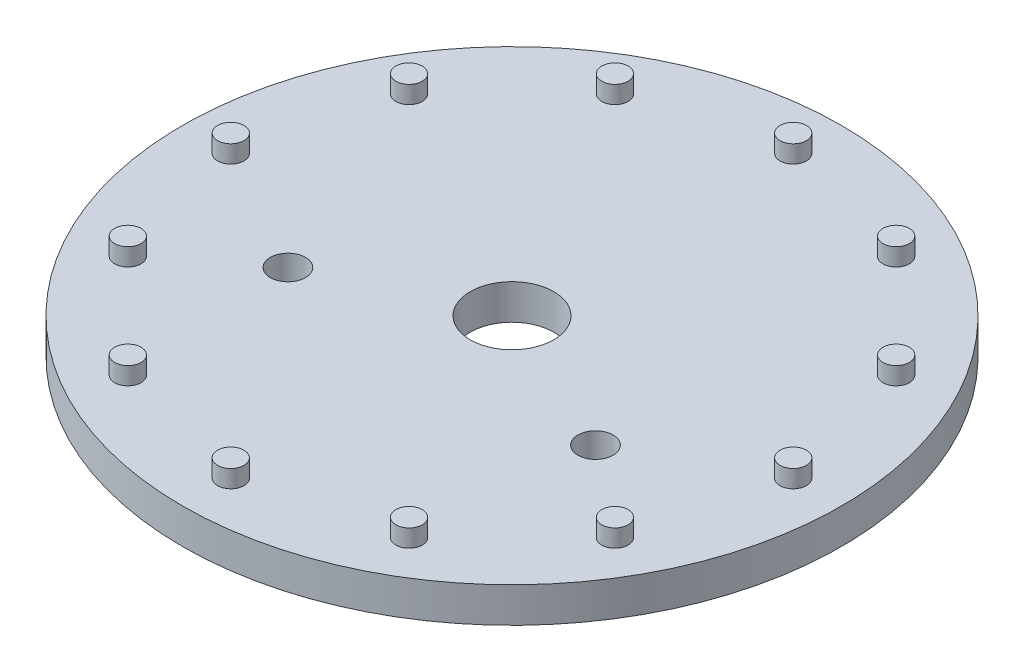
ISO-10303-21;
HEADER;
FILE_DESCRIPTION(('STEP AP214'),'2;1');
FILE_NAME('part.step','',(''),(''),'','','');
FILE_SCHEMA(('AUTOMOTIVE_DESIGN { 1 0 10303 214 1 1 1 1 }'));
ENDSEC;
DATA;
#1=APPLICATION_CONTEXT('core data for automotive mechanical design processes');
#2=APPLICATION_PROTOCOL_DEFINITION('international standard','automotive_design',2000,#1);
#3=PRODUCT_CONTEXT('',#1,'mechanical');
#4=PRODUCT('Part','Part','',(#3));
#5=PRODUCT_RELATED_PRODUCT_CATEGORY('part','',(#4));
#6=PRODUCT_DEFINITION_FORMATION('','',#4);
#7=PRODUCT_DEFINITION_CONTEXT('part definition',#1,'design');
#8=PRODUCT_DEFINITION('design','',#6,#7);
#9=PRODUCT_DEFINITION_SHAPE('','',#8);
#10=(LENGTH_UNIT() NAMED_UNIT(*) SI_UNIT(.MILLI.,.METRE.));
#11=(NAMED_UNIT(*) PLANE_ANGLE_UNIT() SI_UNIT($,.RADIAN.));
#12=(NAMED_UNIT(*) SI_UNIT($,.STERADIAN.) SOLID_ANGLE_UNIT());
#13=UNCERTAINTY_MEASURE_WITH_UNIT(LENGTH_MEASURE(1.E-05),#10,'distance_accuracy_value','');
#14=(GEOMETRIC_REPRESENTATION_CONTEXT(3) GLOBAL_UNCERTAINTY_ASSIGNED_CONTEXT((#13)) GLOBAL_UNIT_ASSIGNED_CONTEXT((#10,
#11,#12)) REPRESENTATION_CONTEXT('',''));
#15=CARTESIAN_POINT('',(0.,0.,0.));
#16=DIRECTION('',(0.,0.,1.));
#17=DIRECTION('',(1.,0.,0.));
#18=AXIS2_PLACEMENT_3D('',#15,#16,#17);
#19=CARTESIAN_POINT('',(0.,4.,0.));
#20=DIRECTION('',(0.,-1.,0.));
#21=DIRECTION('',(0.,0.,-1.));
#22=AXIS2_PLACEMENT_3D('',#19,#20,#21);
#23=CYLINDRICAL_SURFACE('',#22,37.5);
#24=CARTESIAN_POINT('',(0.,4.,0.));
#25=DIRECTION('',(0.,1.,0.));
#26=DIRECTION('',(0.,0.,1.));
#27=AXIS2_PLACEMENT_3D('',#24,#25,#26);
#28=CIRCLE('',#27,37.5);
#29=CARTESIAN_POINT('',(0.,4.,37.5));
#30=VERTEX_POINT('',#29);
#31=EDGE_CURVE('E10',#30,#30,#28,.T.);
#32=ORIENTED_EDGE('',*,*,#31,.F.);
#33=EDGE_LOOP('',(#32));
#34=FACE_BOUND('',#33,.T.);
#35=CARTESIAN_POINT('',(0.,0.,0.));
#36=DIRECTION('',(0.,1.,0.));
#37=DIRECTION('',(0.,0.,1.));
#38=AXIS2_PLACEMENT_3D('',#35,#36,#37);
#39=CIRCLE('',#38,37.5);
#40=CARTESIAN_POINT('',(0.,0.,37.5));
#41=VERTEX_POINT('',#40);
#42=EDGE_CURVE('E38',#41,#41,#39,.T.);
#43=ORIENTED_EDGE('',*,*,#42,.T.);
#44=EDGE_LOOP('',(#43));
#45=FACE_BOUND('',#44,.T.);
#46=ADVANCED_FACE('F31',(#34,#45),#23,.T.);
#47=CARTESIAN_POINT('',(0.,4.,0.));
#48=DIRECTION('',(0.,1.,0.));
#49=DIRECTION('',(0.,0.,1.));
#50=AXIS2_PLACEMENT_3D('',#47,#48,#49);
#51=PLANE('',#50);
#52=CARTESIAN_POINT('',(0.,4.,0.));
#53=DIRECTION('',(0.,1.,0.));
#54=DIRECTION('',(0.,0.,1.));
#55=AXIS2_PLACEMENT_3D('',#52,#53,#54);
#56=CIRCLE('',#55,4.75);
#57=CARTESIAN_POINT('',(0.,4.,4.75));
#58=VERTEX_POINT('',#57);
#59=EDGE_CURVE('E65',#58,#58,#56,.T.);
#60=ORIENTED_EDGE('',*,*,#59,.F.);
#61=EDGE_LOOP('',(#60));
#62=FACE_BOUND('',#61,.T.);
#63=CARTESIAN_POINT('',(17.5,4.,8.));
#64=DIRECTION('',(0.,1.,0.));
#65=DIRECTION('',(0.,0.,1.));
#66=AXIS2_PLACEMENT_3D('',#63,#64,#65);
#67=CIRCLE('',#66,2.);
#68=CARTESIAN_POINT('',(17.5,4.,10.));
#69=VERTEX_POINT('',#68);
#70=EDGE_CURVE('E55',#69,#69,#67,.T.);
#71=ORIENTED_EDGE('',*,*,#70,.F.);
#72=EDGE_LOOP('',(#71));
#73=FACE_BOUND('',#72,.T.);
#74=CARTESIAN_POINT('',(-17.5,4.,8.));
#75=DIRECTION('',(0.,1.,0.));
#76=DIRECTION('',(0.,0.,1.));
#77=AXIS2_PLACEMENT_3D('',#74,#75,#76);
#78=CIRCLE('',#77,2.);
#79=CARTESIAN_POINT('',(-17.5,4.,10.));
#80=VERTEX_POINT('',#79);
#81=EDGE_CURVE('E52',#80,#80,#78,.T.);
#82=ORIENTED_EDGE('',*,*,#81,.F.);
#83=EDGE_LOOP('',(#82));
#84=FACE_BOUND('',#83,.T.);
#85=CARTESIAN_POINT('',(-15.9999999999994,4.,-27.7128129210997));
#86=DIRECTION('',(0.,1.,0.));
#87=DIRECTION('',(0.,0.,1.));
#88=AXIS2_PLACEMENT_3D('',#85,#86,#87);
#89=CIRCLE('',#88,1.5);
#90=CARTESIAN_POINT('',(-15.9999999999994,4.,-26.2128129210997));
#91=VERTEX_POINT('',#90);
#92=EDGE_CURVE('E51',#91,#91,#89,.T.);
#93=ORIENTED_EDGE('',*,*,#92,.F.);
#94=EDGE_LOOP('',(#93));
#95=FACE_BOUND('',#94,.T.);
#96=CARTESIAN_POINT('',(-27.7128129210997,4.,-15.999999999996));
#97=DIRECTION('',(0.,1.,0.));
#98=DIRECTION('',(0.,0.,1.));
#99=AXIS2_PLACEMENT_3D('',#96,#97,#98);
#100=CIRCLE('',#99,1.5);
#101=CARTESIAN_POINT('',(-27.7128129210997,4.,-14.499999999996));
#102=VERTEX_POINT('',#101);
#103=EDGE_CURVE('E71',#102,#102,#100,.T.);
#104=ORIENTED_EDGE('',*,*,#103,.F.);
#105=EDGE_LOOP('',(#104));
#106=FACE_BOUND('',#105,.T.);
#107=CARTESIAN_POINT('',(-31.9999999999954,4.,4.61686997722842E-12));
#108=DIRECTION('',(0.,1.,0.));
#109=DIRECTION('',(0.,0.,1.));
#110=AXIS2_PLACEMENT_3D('',#107,#108,#109);
#111=CIRCLE('',#110,1.5);
#112=CARTESIAN_POINT('',(-31.9999999999954,4.,1.50000000000462));
#113=VERTEX_POINT('',#112);
#114=EDGE_CURVE('E77',#113,#113,#111,.T.);
#115=ORIENTED_EDGE('',*,*,#114,.F.);
#116=EDGE_LOOP('',(#115));
#117=FACE_BOUND('',#116,.T.);
#118=CARTESIAN_POINT('',(-27.7128129210951,4.,16.000000000004));
#119=DIRECTION('',(0.,1.,0.));
#120=DIRECTION('',(0.,0.,1.));
#121=AXIS2_PLACEMENT_3D('',#118,#119,#120);
#122=CIRCLE('',#121,1.5);
#123=CARTESIAN_POINT('',(-27.7128129210951,4.,17.500000000004));
#124=VERTEX_POINT('',#123);
#125=EDGE_CURVE('E83',#124,#124,#122,.T.);
#126=ORIENTED_EDGE('',*,*,#125,.F.);
#127=EDGE_LOOP('',(#126));
#128=FACE_BOUND('',#127,.T.);
#129=CARTESIAN_POINT('',(-15.9999999999914,4.,27.7128129211043));
#130=DIRECTION('',(0.,1.,0.));
#131=DIRECTION('',(0.,0.,1.));
#132=AXIS2_PLACEMENT_3D('',#129,#130,#131);
#133=CIRCLE('',#132,1.5);
#134=CARTESIAN_POINT('',(-15.9999999999914,4.,29.2128129211043));
#135=VERTEX_POINT('',#134);
#136=EDGE_CURVE('E89',#135,#135,#133,.T.);
#137=ORIENTED_EDGE('',*,*,#136,.F.);
#138=EDGE_LOOP('',(#137));
#139=FACE_BOUND('',#138,.T.);
#140=CARTESIAN_POINT('',(9.2259022149423E-12,4.,32.));
#141=DIRECTION('',(0.,1.,0.));
#142=DIRECTION('',(0.,0.,1.));
#143=AXIS2_PLACEMENT_3D('',#140,#141,#142);
#144=CIRCLE('',#143,1.5);
#145=CARTESIAN_POINT('',(9.2259022149423E-12,4.,33.5));
#146=VERTEX_POINT('',#145);
#147=EDGE_CURVE('E95',#146,#146,#144,.T.);
#148=ORIENTED_EDGE('',*,*,#147,.F.);
#149=EDGE_LOOP('',(#148));
#150=FACE_BOUND('',#149,.T.);
#151=CARTESIAN_POINT('',(16.0000000000086,4.,27.7128129210997));
#152=DIRECTION('',(0.,1.,0.));
#153=DIRECTION('',(0.,0.,1.));
#154=AXIS2_PLACEMENT_3D('',#151,#152,#153);
#155=CIRCLE('',#154,1.5);
#156=CARTESIAN_POINT('',(16.0000000000086,4.,29.2128129210997));
#157=VERTEX_POINT('',#156);
#158=EDGE_CURVE('E101',#157,#157,#155,.T.);
#159=ORIENTED_EDGE('',*,*,#158,.F.);
#160=EDGE_LOOP('',(#159));
#161=FACE_BOUND('',#160,.T.);
#162=CARTESIAN_POINT('',(27.712812921109,4.,15.999999999996));
#163=DIRECTION('',(0.,1.,0.));
#164=DIRECTION('',(0.,0.,1.));
#165=AXIS2_PLACEMENT_3D('',#162,#163,#164);
#166=CIRCLE('',#165,1.5);
#167=CARTESIAN_POINT('',(27.712812921109,4.,17.499999999996));
#168=VERTEX_POINT('',#167);
#169=EDGE_CURVE('E107',#168,#168,#166,.T.);
#170=ORIENTED_EDGE('',*,*,#169,.F.);
#171=EDGE_LOOP('',(#170));
#172=FACE_BOUND('',#171,.T.);
#173=CARTESIAN_POINT('',(32.0000000000046,4.,-4.61295110747115E-12));
#174=DIRECTION('',(0.,1.,0.));
#175=DIRECTION('',(0.,0.,1.));
#176=AXIS2_PLACEMENT_3D('',#173,#174,#175);
#177=CIRCLE('',#176,1.5);
#178=CARTESIAN_POINT('',(32.0000000000046,4.,1.49999999999539));
#179=VERTEX_POINT('',#178);
#180=EDGE_CURVE('E113',#179,#179,#177,.T.);
#181=ORIENTED_EDGE('',*,*,#180,.F.);
#182=EDGE_LOOP('',(#181));
#183=FACE_BOUND('',#182,.T.);
#184=CARTESIAN_POINT('',(27.7128129211043,4.,-16.000000000004));
#185=DIRECTION('',(0.,1.,0.));
#186=DIRECTION('',(0.,0.,1.));
#187=AXIS2_PLACEMENT_3D('',#184,#185,#186);
#188=CIRCLE('',#187,1.5);
#189=CARTESIAN_POINT('',(27.7128129211043,4.,-14.500000000004));
#190=VERTEX_POINT('',#189);
#191=EDGE_CURVE('E119',#190,#190,#188,.T.);
#192=ORIENTED_EDGE('',*,*,#191,.F.);
#193=EDGE_LOOP('',(#192));
#194=FACE_BOUND('',#193,.T.);
#195=CARTESIAN_POINT('',(16.0000000000006,4.,-27.7128129211043));
#196=DIRECTION('',(0.,1.,0.));
#197=DIRECTION('',(0.,0.,1.));
#198=AXIS2_PLACEMENT_3D('',#195,#196,#197);
#199=CIRCLE('',#198,1.5);
#200=CARTESIAN_POINT('',(16.0000000000006,4.,-26.2128129211043));
#201=VERTEX_POINT('',#200);
#202=EDGE_CURVE('E125',#201,#201,#199,.T.);
#203=ORIENTED_EDGE('',*,*,#202,.F.);
#204=EDGE_LOOP('',(#203));
#205=FACE_BOUND('',#204,.T.);
#206=CARTESIAN_POINT('',(0.,4.,-32.));
#207=DIRECTION('',(0.,1.,0.));
#208=DIRECTION('',(0.,0.,1.));
#209=AXIS2_PLACEMENT_3D('',#206,#207,#208);
#210=CIRCLE('',#209,1.5);
#211=CARTESIAN_POINT('',(0.,4.,-30.5));
#212=VERTEX_POINT('',#211);
#213=EDGE_CURVE('E46',#212,#212,#210,.T.);
#214=ORIENTED_EDGE('',*,*,#213,.F.);
#215=EDGE_LOOP('',(#214));
#216=FACE_BOUND('',#215,.T.);
#217=ORIENTED_EDGE('',*,*,#31,.T.);
#218=EDGE_LOOP('',(#217));
#219=FACE_BOUND('',#218,.T.);
#220=ADVANCED_FACE('F140',(#62,#73,#84,#95,#106,#117,#128,#139,#150,#161,#172,#183,#194,#205,
#216,#219),#51,.T.);
#221=CARTESIAN_POINT('',(0.,0.,0.));
#222=DIRECTION('',(0.,1.,0.));
#223=DIRECTION('',(0.,0.,1.));
#224=AXIS2_PLACEMENT_3D('',#221,#222,#223);
#225=PLANE('',#224);
#226=CARTESIAN_POINT('',(0.,0.,0.));
#227=DIRECTION('',(0.,1.,0.));
#228=DIRECTION('',(0.,0.,1.));
#229=AXIS2_PLACEMENT_3D('',#226,#227,#228);
#230=CIRCLE('',#229,4.75);
#231=CARTESIAN_POINT('',(0.,0.,4.75));
#232=VERTEX_POINT('',#231);
#233=EDGE_CURVE('E34',#232,#232,#230,.T.);
#234=ORIENTED_EDGE('',*,*,#233,.T.);
#235=EDGE_LOOP('',(#234));
#236=FACE_BOUND('',#235,.T.);
#237=CARTESIAN_POINT('',(17.5,0.,8.));
#238=DIRECTION('',(0.,1.,0.));
#239=DIRECTION('',(0.,0.,1.));
#240=AXIS2_PLACEMENT_3D('',#237,#238,#239);
#241=CIRCLE('',#240,2.);
#242=CARTESIAN_POINT('',(17.5,0.,10.));
#243=VERTEX_POINT('',#242);
#244=EDGE_CURVE('E53',#243,#243,#241,.T.);
#245=ORIENTED_EDGE('',*,*,#244,.T.);
#246=EDGE_LOOP('',(#245));
#247=FACE_BOUND('',#246,.T.);
#248=CARTESIAN_POINT('',(-17.5,0.,8.));
#249=DIRECTION('',(0.,1.,0.));
#250=DIRECTION('',(0.,0.,1.));
#251=AXIS2_PLACEMENT_3D('',#248,#249,#250);
#252=CIRCLE('',#251,2.);
#253=CARTESIAN_POINT('',(-17.5,0.,10.));
#254=VERTEX_POINT('',#253);
#255=EDGE_CURVE('E49',#254,#254,#252,.T.);
#256=ORIENTED_EDGE('',*,*,#255,.T.);
#257=EDGE_LOOP('',(#256));
#258=FACE_BOUND('',#257,.T.);
#259=ORIENTED_EDGE('',*,*,#42,.F.);
#260=EDGE_LOOP('',(#259));
#261=FACE_BOUND('',#260,.T.);
#262=ADVANCED_FACE('F142',(#236,#247,#258,#261),#225,.F.);
#263=CARTESIAN_POINT('',(0.,6.,-32.));
#264=DIRECTION('',(0.,-1.,0.));
#265=DIRECTION('',(0.,0.,-1.));
#266=AXIS2_PLACEMENT_3D('',#263,#264,#265);
#267=CYLINDRICAL_SURFACE('',#266,1.5);
#268=CARTESIAN_POINT('',(0.,6.,-32.));
#269=DIRECTION('',(0.,1.,0.));
#270=DIRECTION('',(0.,0.,1.));
#271=AXIS2_PLACEMENT_3D('',#268,#269,#270);
#272=CIRCLE('',#271,1.5);
#273=CARTESIAN_POINT('',(0.,6.,-30.5));
#274=VERTEX_POINT('',#273);
#275=EDGE_CURVE('E43',#274,#274,#272,.T.);
#276=ORIENTED_EDGE('',*,*,#275,.F.);
#277=EDGE_LOOP('',(#276));
#278=FACE_BOUND('',#277,.T.);
#279=ORIENTED_EDGE('',*,*,#213,.T.);
#280=EDGE_LOOP('',(#279));
#281=FACE_BOUND('',#280,.T.);
#282=ADVANCED_FACE('F138',(#278,#281),#267,.T.);
#283=CARTESIAN_POINT('',(0.,6.,-32.));
#284=DIRECTION('',(0.,1.,0.));
#285=DIRECTION('',(0.,0.,1.));
#286=AXIS2_PLACEMENT_3D('',#283,#284,#285);
#287=PLANE('',#286);
#288=ORIENTED_EDGE('',*,*,#275,.T.);
#289=EDGE_LOOP('',(#288));
#290=FACE_BOUND('',#289,.T.);
#291=ADVANCED_FACE('F156',(#290),#287,.T.);
#292=CARTESIAN_POINT('',(16.0000000000006,6.,-27.7128129211043));
#293=DIRECTION('',(0.,-1.,0.));
#294=DIRECTION('',(0.,0.,-1.));
#295=AXIS2_PLACEMENT_3D('',#292,#293,#294);
#296=CYLINDRICAL_SURFACE('',#295,1.5);
#297=CARTESIAN_POINT('',(16.0000000000006,6.,-27.7128129211043));
#298=DIRECTION('',(0.,1.,0.));
#299=DIRECTION('',(0.,0.,1.));
#300=AXIS2_PLACEMENT_3D('',#297,#298,#299);
#301=CIRCLE('',#300,1.5);
#302=CARTESIAN_POINT('',(16.0000000000006,6.,-26.2128129211043));
#303=VERTEX_POINT('',#302);
#304=EDGE_CURVE('E128',#303,#303,#301,.T.);
#305=ORIENTED_EDGE('',*,*,#304,.F.);
#306=EDGE_LOOP('',(#305));
#307=FACE_BOUND('',#306,.T.);
#308=ORIENTED_EDGE('',*,*,#202,.T.);
#309=EDGE_LOOP('',(#308));
#310=FACE_BOUND('',#309,.T.);
#311=ADVANCED_FACE('F160',(#307,#310),#296,.T.);
#312=CARTESIAN_POINT('',(16.0000000000006,6.,-27.7128129211043));
#313=DIRECTION('',(0.,1.,0.));
#314=DIRECTION('',(0.,0.,1.));
#315=AXIS2_PLACEMENT_3D('',#312,#313,#314);
#316=PLANE('',#315);
#317=ORIENTED_EDGE('',*,*,#304,.T.);
#318=EDGE_LOOP('',(#317));
#319=FACE_BOUND('',#318,.T.);
#320=ADVANCED_FACE('F163',(#319),#316,.T.);
#321=CARTESIAN_POINT('',(27.7128129211043,6.,-16.000000000004));
#322=DIRECTION('',(0.,-1.,0.));
#323=DIRECTION('',(0.,0.,-1.));
#324=AXIS2_PLACEMENT_3D('',#321,#322,#323);
#325=CYLINDRICAL_SURFACE('',#324,1.5);
#326=CARTESIAN_POINT('',(27.7128129211043,6.,-16.000000000004));
#327=DIRECTION('',(0.,1.,0.));
#328=DIRECTION('',(0.,0.,1.));
#329=AXIS2_PLACEMENT_3D('',#326,#327,#328);
#330=CIRCLE('',#329,1.5);
#331=CARTESIAN_POINT('',(27.7128129211043,6.,-14.500000000004));
#332=VERTEX_POINT('',#331);
#333=EDGE_CURVE('E122',#332,#332,#330,.T.);
#334=ORIENTED_EDGE('',*,*,#333,.F.);
#335=EDGE_LOOP('',(#334));
#336=FACE_BOUND('',#335,.T.);
#337=ORIENTED_EDGE('',*,*,#191,.T.);
#338=EDGE_LOOP('',(#337));
#339=FACE_BOUND('',#338,.T.);
#340=ADVANCED_FACE('F167',(#336,#339),#325,.T.);
#341=CARTESIAN_POINT('',(27.7128129211043,6.,-16.000000000004));
#342=DIRECTION('',(0.,1.,0.));
#343=DIRECTION('',(0.,0.,1.));
#344=AXIS2_PLACEMENT_3D('',#341,#342,#343);
#345=PLANE('',#344);
#346=ORIENTED_EDGE('',*,*,#333,.T.);
#347=EDGE_LOOP('',(#346));
#348=FACE_BOUND('',#347,.T.);
#349=ADVANCED_FACE('F171',(#348),#345,.T.);
#350=CARTESIAN_POINT('',(32.0000000000046,6.,-4.61295110747115E-12));
#351=DIRECTION('',(0.,-1.,0.));
#352=DIRECTION('',(0.,0.,-1.));
#353=AXIS2_PLACEMENT_3D('',#350,#351,#352);
#354=CYLINDRICAL_SURFACE('',#353,1.5);
#355=CARTESIAN_POINT('',(32.0000000000046,6.,-4.61295110747115E-12));
#356=DIRECTION('',(0.,1.,0.));
#357=DIRECTION('',(0.,0.,1.));
#358=AXIS2_PLACEMENT_3D('',#355,#356,#357);
#359=CIRCLE('',#358,1.5);
#360=CARTESIAN_POINT('',(32.0000000000046,6.,1.49999999999539));
#361=VERTEX_POINT('',#360);
#362=EDGE_CURVE('E116',#361,#361,#359,.T.);
#363=ORIENTED_EDGE('',*,*,#362,.F.);
#364=EDGE_LOOP('',(#363));
#365=FACE_BOUND('',#364,.T.);
#366=ORIENTED_EDGE('',*,*,#180,.T.);
#367=EDGE_LOOP('',(#366));
#368=FACE_BOUND('',#367,.T.);
#369=ADVANCED_FACE('F175',(#365,#368),#354,.T.);
#370=CARTESIAN_POINT('',(32.0000000000046,6.,-4.61295110747115E-12));
#371=DIRECTION('',(0.,1.,0.));
#372=DIRECTION('',(0.,0.,1.));
#373=AXIS2_PLACEMENT_3D('',#370,#371,#372);
#374=PLANE('',#373);
#375=ORIENTED_EDGE('',*,*,#362,.T.);
#376=EDGE_LOOP('',(#375));
#377=FACE_BOUND('',#376,.T.);
#378=ADVANCED_FACE('F179',(#377),#374,.T.);
#379=CARTESIAN_POINT('',(27.712812921109,6.,15.999999999996));
#380=DIRECTION('',(0.,-1.,0.));
#381=DIRECTION('',(0.,0.,-1.));
#382=AXIS2_PLACEMENT_3D('',#379,#380,#381);
#383=CYLINDRICAL_SURFACE('',#382,1.5);
#384=CARTESIAN_POINT('',(27.712812921109,6.,15.999999999996));
#385=DIRECTION('',(0.,1.,0.));
#386=DIRECTION('',(0.,0.,1.));
#387=AXIS2_PLACEMENT_3D('',#384,#385,#386);
#388=CIRCLE('',#387,1.5);
#389=CARTESIAN_POINT('',(27.712812921109,6.,17.499999999996));
#390=VERTEX_POINT('',#389);
#391=EDGE_CURVE('E110',#390,#390,#388,.T.);
#392=ORIENTED_EDGE('',*,*,#391,.F.);
#393=EDGE_LOOP('',(#392));
#394=FACE_BOUND('',#393,.T.);
#395=ORIENTED_EDGE('',*,*,#169,.T.);
#396=EDGE_LOOP('',(#395));
#397=FACE_BOUND('',#396,.T.);
#398=ADVANCED_FACE('F183',(#394,#397),#383,.T.);
#399=CARTESIAN_POINT('',(27.712812921109,6.,15.999999999996));
#400=DIRECTION('',(0.,1.,0.));
#401=DIRECTION('',(0.,0.,1.));
#402=AXIS2_PLACEMENT_3D('',#399,#400,#401);
#403=PLANE('',#402);
#404=ORIENTED_EDGE('',*,*,#391,.T.);
#405=EDGE_LOOP('',(#404));
#406=FACE_BOUND('',#405,.T.);
#407=ADVANCED_FACE('F187',(#406),#403,.T.);
#408=CARTESIAN_POINT('',(16.0000000000086,6.,27.7128129210997));
#409=DIRECTION('',(0.,-1.,0.));
#410=DIRECTION('',(0.,0.,-1.));
#411=AXIS2_PLACEMENT_3D('',#408,#409,#410);
#412=CYLINDRICAL_SURFACE('',#411,1.5);
#413=CARTESIAN_POINT('',(16.0000000000086,6.,27.7128129210997));
#414=DIRECTION('',(0.,1.,0.));
#415=DIRECTION('',(0.,0.,1.));
#416=AXIS2_PLACEMENT_3D('',#413,#414,#415);
#417=CIRCLE('',#416,1.5);
#418=CARTESIAN_POINT('',(16.0000000000086,6.,29.2128129210997));
#419=VERTEX_POINT('',#418);
#420=EDGE_CURVE('E104',#419,#419,#417,.T.);
#421=ORIENTED_EDGE('',*,*,#420,.F.);
#422=EDGE_LOOP('',(#421));
#423=FACE_BOUND('',#422,.T.);
#424=ORIENTED_EDGE('',*,*,#158,.T.);
#425=EDGE_LOOP('',(#424));
#426=FACE_BOUND('',#425,.T.);
#427=ADVANCED_FACE('F191',(#423,#426),#412,.T.);
#428=CARTESIAN_POINT('',(16.0000000000086,6.,27.7128129210997));
#429=DIRECTION('',(0.,1.,0.));
#430=DIRECTION('',(0.,0.,1.));
#431=AXIS2_PLACEMENT_3D('',#428,#429,#430);
#432=PLANE('',#431);
#433=ORIENTED_EDGE('',*,*,#420,.T.);
#434=EDGE_LOOP('',(#433));
#435=FACE_BOUND('',#434,.T.);
#436=ADVANCED_FACE('F195',(#435),#432,.T.);
#437=CARTESIAN_POINT('',(9.2259022149423E-12,6.,32.));
#438=DIRECTION('',(0.,-1.,0.));
#439=DIRECTION('',(0.,0.,-1.));
#440=AXIS2_PLACEMENT_3D('',#437,#438,#439);
#441=CYLINDRICAL_SURFACE('',#440,1.5);
#442=CARTESIAN_POINT('',(9.2259022149423E-12,6.,32.));
#443=DIRECTION('',(0.,1.,0.));
#444=DIRECTION('',(0.,0.,1.));
#445=AXIS2_PLACEMENT_3D('',#442,#443,#444);
#446=CIRCLE('',#445,1.5);
#447=CARTESIAN_POINT('',(9.2259022149423E-12,6.,33.5));
#448=VERTEX_POINT('',#447);
#449=EDGE_CURVE('E98',#448,#448,#446,.T.);
#450=ORIENTED_EDGE('',*,*,#449,.F.);
#451=EDGE_LOOP('',(#450));
#452=FACE_BOUND('',#451,.T.);
#453=ORIENTED_EDGE('',*,*,#147,.T.);
#454=EDGE_LOOP('',(#453));
#455=FACE_BOUND('',#454,.T.);
#456=ADVANCED_FACE('F199',(#452,#455),#441,.T.);
#457=CARTESIAN_POINT('',(9.2259022149423E-12,6.,32.));
#458=DIRECTION('',(0.,1.,0.));
#459=DIRECTION('',(0.,0.,1.));
#460=AXIS2_PLACEMENT_3D('',#457,#458,#459);
#461=PLANE('',#460);
#462=ORIENTED_EDGE('',*,*,#449,.T.);
#463=EDGE_LOOP('',(#462));
#464=FACE_BOUND('',#463,.T.);
#465=ADVANCED_FACE('F203',(#464),#461,.T.);
#466=CARTESIAN_POINT('',(-15.9999999999914,6.,27.7128129211043));
#467=DIRECTION('',(0.,-1.,0.));
#468=DIRECTION('',(0.,0.,-1.));
#469=AXIS2_PLACEMENT_3D('',#466,#467,#468);
#470=CYLINDRICAL_SURFACE('',#469,1.5);
#471=CARTESIAN_POINT('',(-15.9999999999914,6.,27.7128129211043));
#472=DIRECTION('',(0.,1.,0.));
#473=DIRECTION('',(0.,0.,1.));
#474=AXIS2_PLACEMENT_3D('',#471,#472,#473);
#475=CIRCLE('',#474,1.5);
#476=CARTESIAN_POINT('',(-15.9999999999914,6.,29.2128129211043));
#477=VERTEX_POINT('',#476);
#478=EDGE_CURVE('E92',#477,#477,#475,.T.);
#479=ORIENTED_EDGE('',*,*,#478,.F.);
#480=EDGE_LOOP('',(#479));
#481=FACE_BOUND('',#480,.T.);
#482=ORIENTED_EDGE('',*,*,#136,.T.);
#483=EDGE_LOOP('',(#482));
#484=FACE_BOUND('',#483,.T.);
#485=ADVANCED_FACE('F207',(#481,#484),#470,.T.);
#486=CARTESIAN_POINT('',(-15.9999999999914,6.,27.7128129211043));
#487=DIRECTION('',(0.,1.,0.));
#488=DIRECTION('',(0.,0.,1.));
#489=AXIS2_PLACEMENT_3D('',#486,#487,#488);
#490=PLANE('',#489);
#491=ORIENTED_EDGE('',*,*,#478,.T.);
#492=EDGE_LOOP('',(#491));
#493=FACE_BOUND('',#492,.T.);
#494=ADVANCED_FACE('F211',(#493),#490,.T.);
#495=CARTESIAN_POINT('',(-27.7128129210951,6.,16.000000000004));
#496=DIRECTION('',(0.,-1.,0.));
#497=DIRECTION('',(0.,0.,-1.));
#498=AXIS2_PLACEMENT_3D('',#495,#496,#497);
#499=CYLINDRICAL_SURFACE('',#498,1.5);
#500=CARTESIAN_POINT('',(-27.7128129210951,6.,16.000000000004));
#501=DIRECTION('',(0.,1.,0.));
#502=DIRECTION('',(0.,0.,1.));
#503=AXIS2_PLACEMENT_3D('',#500,#501,#502);
#504=CIRCLE('',#503,1.5);
#505=CARTESIAN_POINT('',(-27.7128129210951,6.,17.500000000004));
#506=VERTEX_POINT('',#505);
#507=EDGE_CURVE('E86',#506,#506,#504,.T.);
#508=ORIENTED_EDGE('',*,*,#507,.F.);
#509=EDGE_LOOP('',(#508));
#510=FACE_BOUND('',#509,.T.);
#511=ORIENTED_EDGE('',*,*,#125,.T.);
#512=EDGE_LOOP('',(#511));
#513=FACE_BOUND('',#512,.T.);
#514=ADVANCED_FACE('F215',(#510,#513),#499,.T.);
#515=CARTESIAN_POINT('',(-27.7128129210951,6.,16.000000000004));
#516=DIRECTION('',(0.,1.,0.));
#517=DIRECTION('',(0.,0.,1.));
#518=AXIS2_PLACEMENT_3D('',#515,#516,#517);
#519=PLANE('',#518);
#520=ORIENTED_EDGE('',*,*,#507,.T.);
#521=EDGE_LOOP('',(#520));
#522=FACE_BOUND('',#521,.T.);
#523=ADVANCED_FACE('F219',(#522),#519,.T.);
#524=CARTESIAN_POINT('',(-31.9999999999954,6.,4.61686997722842E-12));
#525=DIRECTION('',(0.,-1.,0.));
#526=DIRECTION('',(0.,0.,-1.));
#527=AXIS2_PLACEMENT_3D('',#524,#525,#526);
#528=CYLINDRICAL_SURFACE('',#527,1.5);
#529=CARTESIAN_POINT('',(-31.9999999999954,6.,4.61686997722842E-12));
#530=DIRECTION('',(0.,1.,0.));
#531=DIRECTION('',(0.,0.,1.));
#532=AXIS2_PLACEMENT_3D('',#529,#530,#531);
#533=CIRCLE('',#532,1.5);
#534=CARTESIAN_POINT('',(-31.9999999999954,6.,1.50000000000462));
#535=VERTEX_POINT('',#534);
#536=EDGE_CURVE('E80',#535,#535,#533,.T.);
#537=ORIENTED_EDGE('',*,*,#536,.F.);
#538=EDGE_LOOP('',(#537));
#539=FACE_BOUND('',#538,.T.);
#540=ORIENTED_EDGE('',*,*,#114,.T.);
#541=EDGE_LOOP('',(#540));
#542=FACE_BOUND('',#541,.T.);
#543=ADVANCED_FACE('F223',(#539,#542),#528,.T.);
#544=CARTESIAN_POINT('',(-31.9999999999954,6.,4.61686997722842E-12));
#545=DIRECTION('',(0.,1.,0.));
#546=DIRECTION('',(0.,0.,1.));
#547=AXIS2_PLACEMENT_3D('',#544,#545,#546);
#548=PLANE('',#547);
#549=ORIENTED_EDGE('',*,*,#536,.T.);
#550=EDGE_LOOP('',(#549));
#551=FACE_BOUND('',#550,.T.);
#552=ADVANCED_FACE('F227',(#551),#548,.T.);
#553=CARTESIAN_POINT('',(-27.7128129210997,6.,-15.999999999996));
#554=DIRECTION('',(0.,-1.,0.));
#555=DIRECTION('',(0.,0.,-1.));
#556=AXIS2_PLACEMENT_3D('',#553,#554,#555);
#557=CYLINDRICAL_SURFACE('',#556,1.5);
#558=CARTESIAN_POINT('',(-27.7128129210997,6.,-15.999999999996));
#559=DIRECTION('',(0.,1.,0.));
#560=DIRECTION('',(0.,0.,1.));
#561=AXIS2_PLACEMENT_3D('',#558,#559,#560);
#562=CIRCLE('',#561,1.5);
#563=CARTESIAN_POINT('',(-27.7128129210997,6.,-14.499999999996));
#564=VERTEX_POINT('',#563);
#565=EDGE_CURVE('E74',#564,#564,#562,.T.);
#566=ORIENTED_EDGE('',*,*,#565,.F.);
#567=EDGE_LOOP('',(#566));
#568=FACE_BOUND('',#567,.T.);
#569=ORIENTED_EDGE('',*,*,#103,.T.);
#570=EDGE_LOOP('',(#569));
#571=FACE_BOUND('',#570,.T.);
#572=ADVANCED_FACE('F231',(#568,#571),#557,.T.);
#573=CARTESIAN_POINT('',(-27.7128129210997,6.,-15.999999999996));
#574=DIRECTION('',(0.,1.,0.));
#575=DIRECTION('',(0.,0.,1.));
#576=AXIS2_PLACEMENT_3D('',#573,#574,#575);
#577=PLANE('',#576);
#578=ORIENTED_EDGE('',*,*,#565,.T.);
#579=EDGE_LOOP('',(#578));
#580=FACE_BOUND('',#579,.T.);
#581=ADVANCED_FACE('F235',(#580),#577,.T.);
#582=CARTESIAN_POINT('',(-15.9999999999994,6.,-27.7128129210997));
#583=DIRECTION('',(0.,-1.,0.));
#584=DIRECTION('',(0.,0.,-1.));
#585=AXIS2_PLACEMENT_3D('',#582,#583,#584);
#586=CYLINDRICAL_SURFACE('',#585,1.5);
#587=CARTESIAN_POINT('',(-15.9999999999994,6.,-27.7128129210997));
#588=DIRECTION('',(0.,1.,0.));
#589=DIRECTION('',(0.,0.,1.));
#590=AXIS2_PLACEMENT_3D('',#587,#588,#589);
#591=CIRCLE('',#590,1.5);
#592=CARTESIAN_POINT('',(-15.9999999999994,6.,-26.2128129210997));
#593=VERTEX_POINT('',#592);
#594=EDGE_CURVE('E68',#593,#593,#591,.T.);
#595=ORIENTED_EDGE('',*,*,#594,.F.);
#596=EDGE_LOOP('',(#595));
#597=FACE_BOUND('',#596,.T.);
#598=ORIENTED_EDGE('',*,*,#92,.T.);
#599=EDGE_LOOP('',(#598));
#600=FACE_BOUND('',#599,.T.);
#601=ADVANCED_FACE('F239',(#597,#600),#586,.T.);
#602=CARTESIAN_POINT('',(-15.9999999999994,6.,-27.7128129210997));
#603=DIRECTION('',(0.,1.,0.));
#604=DIRECTION('',(0.,0.,1.));
#605=AXIS2_PLACEMENT_3D('',#602,#603,#604);
#606=PLANE('',#605);
#607=ORIENTED_EDGE('',*,*,#594,.T.);
#608=EDGE_LOOP('',(#607));
#609=FACE_BOUND('',#608,.T.);
#610=ADVANCED_FACE('F243',(#609),#606,.T.);
#611=CARTESIAN_POINT('',(-17.5,-6.,8.));
#612=DIRECTION('',(0.,1.,0.));
#613=DIRECTION('',(0.,0.,1.));
#614=AXIS2_PLACEMENT_3D('',#611,#612,#613);
#615=CYLINDRICAL_SURFACE('',#614,2.);
#616=ORIENTED_EDGE('',*,*,#81,.T.);
#617=EDGE_LOOP('',(#616));
#618=FACE_BOUND('',#617,.T.);
#619=ORIENTED_EDGE('',*,*,#255,.F.);
#620=EDGE_LOOP('',(#619));
#621=FACE_BOUND('',#620,.T.);
#622=ADVANCED_FACE('F247',(#618,#621),#615,.F.);
#623=CARTESIAN_POINT('',(17.5,-6.,8.));
#624=DIRECTION('',(0.,1.,0.));
#625=DIRECTION('',(0.,0.,1.));
#626=AXIS2_PLACEMENT_3D('',#623,#624,#625);
#627=CYLINDRICAL_SURFACE('',#626,2.);
#628=ORIENTED_EDGE('',*,*,#70,.T.);
#629=EDGE_LOOP('',(#628));
#630=FACE_BOUND('',#629,.T.);
#631=ORIENTED_EDGE('',*,*,#244,.F.);
#632=EDGE_LOOP('',(#631));
#633=FACE_BOUND('',#632,.T.);
#634=ADVANCED_FACE('F251',(#630,#633),#627,.F.);
#635=CARTESIAN_POINT('',(0.,-38.,0.));
#636=DIRECTION('',(0.,1.,0.));
#637=DIRECTION('',(0.,0.,1.));
#638=AXIS2_PLACEMENT_3D('',#635,#636,#637);
#639=CYLINDRICAL_SURFACE('',#638,4.75);
#640=ORIENTED_EDGE('',*,*,#59,.T.);
#641=EDGE_LOOP('',(#640));
#642=FACE_BOUND('',#641,.T.);
#643=ORIENTED_EDGE('',*,*,#233,.F.);
#644=EDGE_LOOP('',(#643));
#645=FACE_BOUND('',#644,.T.);
#646=ADVANCED_FACE('F255',(#642,#645),#639,.F.);
#647=CLOSED_SHELL('',(#46,#220,#262,#282,#291,#311,#320,#340,#349,#369,#378,#398,#407,#427,#436,
#456,#465,#485,#494,#514,#523,#543,#552,#572,#581,#601,#610,#622,#634,#646));
#648=MANIFOLD_SOLID_BREP('B2',#647);
#649=ADVANCED_BREP_SHAPE_REPRESENTATION('',(#18,#648),#14);
#650=SHAPE_DEFINITION_REPRESENTATION(#9,#649);
ENDSEC;
END-ISO-10303-21;
